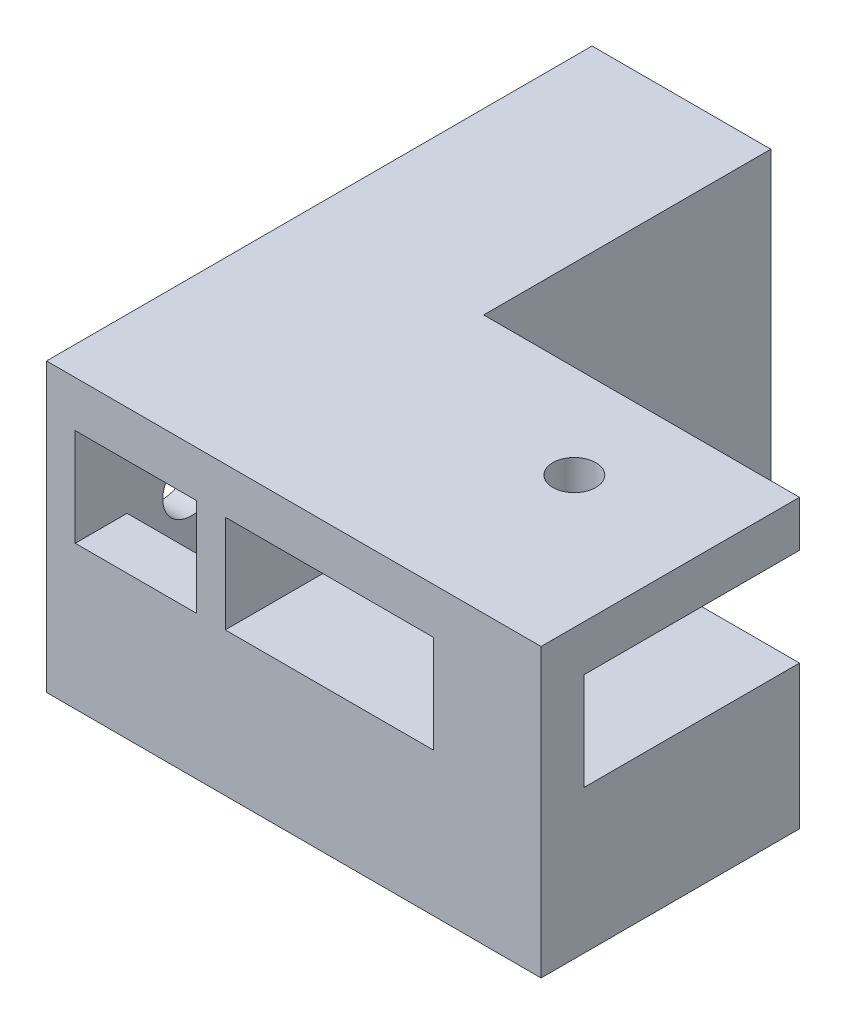
ISO-10303-21;
HEADER;
FILE_DESCRIPTION(('STEP AP214'),'2;1');
FILE_NAME('part.step','',(''),(''),'','','');
FILE_SCHEMA(('AUTOMOTIVE_DESIGN { 1 0 10303 214 1 1 1 1 }'));
ENDSEC;
DATA;
#1=APPLICATION_CONTEXT('core data for automotive mechanical design processes');
#2=APPLICATION_PROTOCOL_DEFINITION('international standard','automotive_design',2000,#1);
#3=PRODUCT_CONTEXT('',#1,'mechanical');
#4=PRODUCT('Part','Part','',(#3));
#5=PRODUCT_RELATED_PRODUCT_CATEGORY('part','',(#4));
#6=PRODUCT_DEFINITION_FORMATION('','',#4);
#7=PRODUCT_DEFINITION_CONTEXT('part definition',#1,'design');
#8=PRODUCT_DEFINITION('design','',#6,#7);
#9=PRODUCT_DEFINITION_SHAPE('','',#8);
#10=(LENGTH_UNIT() NAMED_UNIT(*) SI_UNIT(.MILLI.,.METRE.));
#11=(NAMED_UNIT(*) PLANE_ANGLE_UNIT() SI_UNIT($,.RADIAN.));
#12=(NAMED_UNIT(*) SI_UNIT($,.STERADIAN.) SOLID_ANGLE_UNIT());
#13=UNCERTAINTY_MEASURE_WITH_UNIT(LENGTH_MEASURE(1.E-05),#10,'distance_accuracy_value','');
#14=(GEOMETRIC_REPRESENTATION_CONTEXT(3) GLOBAL_UNCERTAINTY_ASSIGNED_CONTEXT((#13)) GLOBAL_UNIT_ASSIGNED_CONTEXT((#10,
#11,#12)) REPRESENTATION_CONTEXT('',''));
#15=CARTESIAN_POINT('',(0.,0.,0.));
#16=DIRECTION('',(0.,0.,1.));
#17=DIRECTION('',(1.,0.,0.));
#18=AXIS2_PLACEMENT_3D('',#15,#16,#17);
#19=CARTESIAN_POINT('',(0.,5.,-18.));
#20=DIRECTION('',(0.,1.,0.));
#21=DIRECTION('',(0.,0.,1.));
#22=AXIS2_PLACEMENT_3D('',#19,#20,#21);
#23=PLANE('',#22);
#24=DIRECTION('',(-1.,0.,0.));
#25=VECTOR('',#24,1.);
#26=CARTESIAN_POINT('',(0.,5.,-15.9436413169626));
#27=LINE('',#26,#25);
#28=CARTESIAN_POINT('',(-4.375,4.99999999986514,-15.9436413171899));
#29=VERTEX_POINT('',#28);
#30=CARTESIAN_POINT('',(-12.825,4.99999999995493,-15.9436413170386));
#31=VERTEX_POINT('',#30);
#32=EDGE_CURVE('E277',#29,#31,#27,.T.);
#33=ORIENTED_EDGE('',*,*,#32,.F.);
#34=DIRECTION('',(0.,0.,1.));
#35=VECTOR('',#34,1.);
#36=CARTESIAN_POINT('',(-4.37500000000001,5.,-38.));
#37=LINE('',#36,#35);
#38=CARTESIAN_POINT('',(-4.375,5.,-38.));
#39=VERTEX_POINT('',#38);
#40=EDGE_CURVE('E248',#39,#29,#37,.T.);
#41=ORIENTED_EDGE('',*,*,#40,.F.);
#42=DIRECTION('',(-1.,0.,0.));
#43=VECTOR('',#42,1.);
#44=CARTESIAN_POINT('',(0.,5.,-38.));
#45=LINE('',#44,#43);
#46=CARTESIAN_POINT('',(-12.825,5.,-38.));
#47=VERTEX_POINT('',#46);
#48=EDGE_CURVE('E449',#39,#47,#45,.T.);
#49=ORIENTED_EDGE('',*,*,#48,.T.);
#50=DIRECTION('',(0.,0.,-1.));
#51=VECTOR('',#50,1.);
#52=CARTESIAN_POINT('',(-12.825,5.,-38.));
#53=LINE('',#52,#51);
#54=EDGE_CURVE('E310',#31,#47,#53,.T.);
#55=ORIENTED_EDGE('',*,*,#54,.F.);
#56=EDGE_LOOP('',(#33,#41,#49,#55));
#57=FACE_BOUND('',#56,.T.);
#58=ADVANCED_FACE('F40',(#57),#23,.T.);
#59=CARTESIAN_POINT('',(10.44201924,5.,-11.5));
#60=DIRECTION('',(0.,1.,0.));
#61=DIRECTION('',(0.,0.,1.));
#62=AXIS2_PLACEMENT_3D('',#59,#60,#61);
#63=CIRCLE('',#62,1.5);
#64=CARTESIAN_POINT('',(10.44201924,5.,-10.));
#65=VERTEX_POINT('',#64);
#66=EDGE_CURVE('E397',#65,#65,#63,.F.);
#67=ORIENTED_EDGE('',*,*,#66,.T.);
#68=EDGE_LOOP('',(#67));
#69=FACE_BOUND('',#68,.T.);
#70=DIRECTION('',(0.,0.,1.));
#71=VECTOR('',#70,1.);
#72=CARTESIAN_POINT('',(12.125,4.99999999999545,0.));
#73=LINE('',#72,#71);
#74=CARTESIAN_POINT('',(12.125,4.99999999999545,-3.));
#75=VERTEX_POINT('',#74);
#76=CARTESIAN_POINT('',(12.125,4.99999999999545,0.));
#77=VERTEX_POINT('',#76);
#78=EDGE_CURVE('E307',#75,#77,#73,.T.);
#79=ORIENTED_EDGE('',*,*,#78,.F.);
#80=DIRECTION('',(-1.,0.,0.));
#81=VECTOR('',#80,1.);
#82=CARTESIAN_POINT('',(19.625,4.99999999999545,-3.));
#83=LINE('',#82,#81);
#84=CARTESIAN_POINT('',(19.625,4.99999999999545,-3.));
#85=VERTEX_POINT('',#84);
#86=EDGE_CURVE('E304',#85,#75,#83,.T.);
#87=ORIENTED_EDGE('',*,*,#86,.F.);
#88=DIRECTION('',(0.,0.,1.));
#89=VECTOR('',#88,1.);
#90=CARTESIAN_POINT('',(19.625,5.,0.));
#91=LINE('',#90,#89);
#92=CARTESIAN_POINT('',(19.625,5.,-18.));
#93=VERTEX_POINT('',#92);
#94=EDGE_CURVE('E413',#93,#85,#91,.T.);
#95=ORIENTED_EDGE('',*,*,#94,.F.);
#96=DIRECTION('',(-1.,0.,0.));
#97=VECTOR('',#96,1.);
#98=CARTESIAN_POINT('',(0.,5.,-18.));
#99=LINE('',#98,#97);
#100=CARTESIAN_POINT('',(-2.375,5.,-18.));
#101=VERTEX_POINT('',#100);
#102=EDGE_CURVE('E645',#93,#101,#99,.T.);
#103=ORIENTED_EDGE('',*,*,#102,.T.);
#104=DIRECTION('',(0.,0.,-1.));
#105=VECTOR('',#104,1.);
#106=CARTESIAN_POINT('',(-2.37500000000001,5.,-38.));
#107=LINE('',#106,#105);
#108=CARTESIAN_POINT('',(-2.375,5.,0.));
#109=VERTEX_POINT('',#108);
#110=EDGE_CURVE('E388',#109,#101,#107,.T.);
#111=ORIENTED_EDGE('',*,*,#110,.F.);
#112=DIRECTION('',(-1.,0.,0.));
#113=VECTOR('',#112,1.);
#114=CARTESIAN_POINT('',(0.,5.,0.));
#115=LINE('',#114,#113);
#116=EDGE_CURVE('E632',#77,#109,#115,.T.);
#117=ORIENTED_EDGE('',*,*,#116,.F.);
#118=EDGE_LOOP('',(#79,#87,#95,#103,#111,#117));
#119=FACE_BOUND('',#118,.T.);
#120=ADVANCED_FACE('F509',(#69,#119),#23,.T.);
#121=CARTESIAN_POINT('',(0.,11.8,-18.));
#122=DIRECTION('',(0.,1.,0.));
#123=DIRECTION('',(0.,0.,1.));
#124=AXIS2_PLACEMENT_3D('',#121,#122,#123);
#125=PLANE('',#124);
#126=CARTESIAN_POINT('',(10.44201924,11.8,-11.5));
#127=DIRECTION('',(0.,1.,0.));
#128=DIRECTION('',(0.,0.,1.));
#129=AXIS2_PLACEMENT_3D('',#126,#127,#128);
#130=CIRCLE('',#129,1.5);
#131=CARTESIAN_POINT('',(10.44201924,11.8,-10.));
#132=VERTEX_POINT('',#131);
#133=EDGE_CURVE('E329',#132,#132,#130,.F.);
#134=ORIENTED_EDGE('',*,*,#133,.F.);
#135=EDGE_LOOP('',(#134));
#136=FACE_BOUND('',#135,.T.);
#137=DIRECTION('',(1.,0.,0.));
#138=VECTOR('',#137,1.);
#139=CARTESIAN_POINT('',(19.625,11.8,-3.));
#140=LINE('',#139,#138);
#141=CARTESIAN_POINT('',(12.125,11.8,-3.));
#142=VERTEX_POINT('',#141);
#143=CARTESIAN_POINT('',(19.625,11.8,-3.));
#144=VERTEX_POINT('',#143);
#145=EDGE_CURVE('E62',#142,#144,#140,.T.);
#146=ORIENTED_EDGE('',*,*,#145,.F.);
#147=DIRECTION('',(0.,0.,-1.));
#148=VECTOR('',#147,1.);
#149=CARTESIAN_POINT('',(12.125,11.8,0.));
#150=LINE('',#149,#148);
#151=CARTESIAN_POINT('',(12.125,11.8,0.));
#152=VERTEX_POINT('',#151);
#153=EDGE_CURVE('E289',#152,#142,#150,.T.);
#154=ORIENTED_EDGE('',*,*,#153,.F.);
#155=DIRECTION('',(-1.,0.,0.));
#156=VECTOR('',#155,1.);
#157=CARTESIAN_POINT('',(0.,11.8,0.));
#158=LINE('',#157,#156);
#159=CARTESIAN_POINT('',(-2.375,11.7999999999938,0.));
#160=VERTEX_POINT('',#159);
#161=EDGE_CURVE('E596',#152,#160,#158,.T.);
#162=ORIENTED_EDGE('',*,*,#161,.T.);
#163=DIRECTION('',(0.,0.,-1.));
#164=VECTOR('',#163,1.);
#165=CARTESIAN_POINT('',(-2.37500000000001,11.7999999999938,-38.));
#166=LINE('',#165,#164);
#167=CARTESIAN_POINT('',(-2.375,11.7999999999938,-18.));
#168=VERTEX_POINT('',#167);
#169=EDGE_CURVE('E371',#160,#168,#166,.T.);
#170=ORIENTED_EDGE('',*,*,#169,.T.);
#171=DIRECTION('',(-1.,0.,0.));
#172=VECTOR('',#171,1.);
#173=CARTESIAN_POINT('',(0.,11.8,-18.));
#174=LINE('',#173,#172);
#175=CARTESIAN_POINT('',(19.625,11.8,-18.));
#176=VERTEX_POINT('',#175);
#177=EDGE_CURVE('E595',#176,#168,#174,.T.);
#178=ORIENTED_EDGE('',*,*,#177,.F.);
#179=DIRECTION('',(0.,0.,-1.));
#180=VECTOR('',#179,1.);
#181=CARTESIAN_POINT('',(19.625,11.8,0.));
#182=LINE('',#181,#180);
#183=EDGE_CURVE('E333',#144,#176,#182,.T.);
#184=ORIENTED_EDGE('',*,*,#183,.F.);
#185=EDGE_LOOP('',(#146,#154,#162,#170,#178,#184));
#186=FACE_BOUND('',#185,.T.);
#187=ADVANCED_FACE('F513',(#136,#186),#125,.F.);
#188=DIRECTION('',(-1.,0.,0.));
#189=VECTOR('',#188,1.);
#190=CARTESIAN_POINT('',(11.4417453763892,5.,-3.61207246935829));
#191=LINE('',#190,#189);
#192=CARTESIAN_POINT('',(-12.825,5.,-3.61207246935829));
#193=VERTEX_POINT('',#192);
#194=CARTESIAN_POINT('',(-4.375,5.,-3.61207246935829));
#195=VERTEX_POINT('',#194);
#196=EDGE_CURVE('E274',#193,#195,#191,.F.);
#197=ORIENTED_EDGE('',*,*,#196,.F.);
#198=CARTESIAN_POINT('',(-12.825,5.,0.));
#199=VERTEX_POINT('',#198);
#200=EDGE_CURVE('E73',#199,#193,#53,.T.);
#201=ORIENTED_EDGE('',*,*,#200,.F.);
#202=CARTESIAN_POINT('',(-4.375,5.,0.));
#203=VERTEX_POINT('',#202);
#204=EDGE_CURVE('E458',#203,#199,#115,.T.);
#205=ORIENTED_EDGE('',*,*,#204,.F.);
#206=EDGE_CURVE('E44',#195,#203,#37,.T.);
#207=ORIENTED_EDGE('',*,*,#206,.F.);
#208=EDGE_LOOP('',(#197,#201,#205,#207));
#209=FACE_BOUND('',#208,.T.);
#210=ADVANCED_FACE('F42',(#209),#23,.T.);
#211=DIRECTION('',(0.,0.,-1.));
#212=VECTOR('',#211,1.);
#213=CARTESIAN_POINT('',(-12.825,11.7999999999938,-38.));
#214=LINE('',#213,#212);
#215=CARTESIAN_POINT('',(-12.825,11.7999999999938,0.));
#216=VERTEX_POINT('',#215);
#217=CARTESIAN_POINT('',(-12.825,11.7999999999938,-38.));
#218=VERTEX_POINT('',#217);
#219=EDGE_CURVE('E318',#216,#218,#214,.T.);
#220=ORIENTED_EDGE('',*,*,#219,.T.);
#221=DIRECTION('',(-1.,0.,0.));
#222=VECTOR('',#221,1.);
#223=CARTESIAN_POINT('',(0.,11.8,-38.));
#224=LINE('',#223,#222);
#225=CARTESIAN_POINT('',(-4.37500000000001,11.7999999999938,-38.));
#226=VERTEX_POINT('',#225);
#227=EDGE_CURVE('E344',#226,#218,#224,.T.);
#228=ORIENTED_EDGE('',*,*,#227,.F.);
#229=DIRECTION('',(0.,0.,1.));
#230=VECTOR('',#229,1.);
#231=CARTESIAN_POINT('',(-4.37500000000001,11.7999999999938,-38.));
#232=LINE('',#231,#230);
#233=CARTESIAN_POINT('',(-4.375,11.8,0.));
#234=VERTEX_POINT('',#233);
#235=EDGE_CURVE('E383',#226,#234,#232,.T.);
#236=ORIENTED_EDGE('',*,*,#235,.T.);
#237=EDGE_CURVE('E353',#234,#216,#158,.T.);
#238=ORIENTED_EDGE('',*,*,#237,.T.);
#239=EDGE_LOOP('',(#220,#228,#236,#238));
#240=FACE_BOUND('',#239,.T.);
#241=ADVANCED_FACE('F476',(#240),#125,.F.);
#242=CARTESIAN_POINT('',(0.,-2.,-38.));
#243=DIRECTION('',(0.,-1.,0.));
#244=DIRECTION('',(0.,0.,-1.));
#245=AXIS2_PLACEMENT_3D('',#242,#243,#244);
#246=PLANE('',#245);
#247=DIRECTION('',(0.,0.,1.));
#248=VECTOR('',#247,1.);
#249=CARTESIAN_POINT('',(-9.825,-2.,-38.));
#250=LINE('',#249,#248);
#251=CARTESIAN_POINT('',(-9.825,-2.,-38.));
#252=VERTEX_POINT('',#251);
#253=CARTESIAN_POINT('',(-9.825,-2.,-10.));
#254=VERTEX_POINT('',#253);
#255=EDGE_CURVE('E481',#252,#254,#250,.T.);
#256=ORIENTED_EDGE('',*,*,#255,.T.);
#257=DIRECTION('',(1.,0.,0.));
#258=VECTOR('',#257,1.);
#259=CARTESIAN_POINT('',(0.,-2.,-10.));
#260=LINE('',#259,#258);
#261=CARTESIAN_POINT('',(-14.825,-2.,-10.));
#262=VERTEX_POINT('',#261);
#263=EDGE_CURVE('E421',#262,#254,#260,.T.);
#264=ORIENTED_EDGE('',*,*,#263,.F.);
#265=DIRECTION('',(0.,0.,1.));
#266=VECTOR('',#265,1.);
#267=CARTESIAN_POINT('',(-14.825,-2.,-38.));
#268=LINE('',#267,#266);
#269=CARTESIAN_POINT('',(-14.825,-2.,-38.));
#270=VERTEX_POINT('',#269);
#271=EDGE_CURVE('E629',#270,#262,#268,.T.);
#272=ORIENTED_EDGE('',*,*,#271,.F.);
#273=DIRECTION('',(1.,0.,0.));
#274=VECTOR('',#273,1.);
#275=CARTESIAN_POINT('',(0.,-2.,-38.));
#276=LINE('',#275,#274);
#277=EDGE_CURVE('E435',#270,#252,#276,.T.);
#278=ORIENTED_EDGE('',*,*,#277,.T.);
#279=EDGE_LOOP('',(#256,#264,#272,#278));
#280=FACE_BOUND('',#279,.T.);
#281=ADVANCED_FACE('F520',(#280),#246,.T.);
#282=CARTESIAN_POINT('',(-9.825,0.,-38.));
#283=DIRECTION('',(-1.,0.,0.));
#284=DIRECTION('',(0.,0.,1.));
#285=AXIS2_PLACEMENT_3D('',#282,#283,#284);
#286=PLANE('',#285);
#287=DIRECTION('',(0.,0.,1.));
#288=VECTOR('',#287,1.);
#289=CARTESIAN_POINT('',(-9.825,-5.,-38.));
#290=LINE('',#289,#288);
#291=CARTESIAN_POINT('',(-9.825,-5.,-38.));
#292=VERTEX_POINT('',#291);
#293=CARTESIAN_POINT('',(-9.825,-5.,-10.));
#294=VERTEX_POINT('',#293);
#295=EDGE_CURVE('E483',#292,#294,#290,.T.);
#296=ORIENTED_EDGE('',*,*,#295,.T.);
#297=DIRECTION('',(0.,-1.,0.));
#298=VECTOR('',#297,1.);
#299=CARTESIAN_POINT('',(-9.825,0.,-10.));
#300=LINE('',#299,#298);
#301=EDGE_CURVE('E417',#254,#294,#300,.T.);
#302=ORIENTED_EDGE('',*,*,#301,.F.);
#303=ORIENTED_EDGE('',*,*,#255,.F.);
#304=DIRECTION('',(0.,-1.,0.));
#305=VECTOR('',#304,1.);
#306=CARTESIAN_POINT('',(-9.825,0.,-38.));
#307=LINE('',#306,#305);
#308=EDGE_CURVE('E439',#252,#292,#307,.T.);
#309=ORIENTED_EDGE('',*,*,#308,.T.);
#310=EDGE_LOOP('',(#296,#302,#303,#309));
#311=FACE_BOUND('',#310,.T.);
#312=ADVANCED_FACE('F685',(#311),#286,.T.);
#313=CARTESIAN_POINT('',(0.,-5.,-18.));
#314=DIRECTION('',(0.,1.,0.));
#315=DIRECTION('',(-1.,0.,0.));
#316=AXIS2_PLACEMENT_3D('',#313,#314,#315);
#317=PLANE('',#316);
#318=CARTESIAN_POINT('',(10.44201924,-5.,-11.5));
#319=DIRECTION('',(0.,1.,0.));
#320=DIRECTION('',(-1.,0.,0.));
#321=AXIS2_PLACEMENT_3D('',#318,#319,#320);
#322=CIRCLE('',#321,1.5);
#323=CARTESIAN_POINT('',(8.94201924000001,-5.,-11.5));
#324=VERTEX_POINT('',#323);
#325=EDGE_CURVE('E393',#324,#324,#322,.F.);
#326=ORIENTED_EDGE('',*,*,#325,.F.);
#327=EDGE_LOOP('',(#326));
#328=FACE_BOUND('',#327,.T.);
#329=DIRECTION('',(-1.,0.,0.));
#330=VECTOR('',#329,1.);
#331=CARTESIAN_POINT('',(0.,-5.,0.));
#332=LINE('',#331,#330);
#333=CARTESIAN_POINT('',(19.625,-5.,0.));
#334=VERTEX_POINT('',#333);
#335=CARTESIAN_POINT('',(-14.825,-5.,0.));
#336=VERTEX_POINT('',#335);
#337=EDGE_CURVE('E588',#334,#336,#332,.T.);
#338=ORIENTED_EDGE('',*,*,#337,.T.);
#339=DIRECTION('',(0.,0.,1.));
#340=VECTOR('',#339,1.);
#341=CARTESIAN_POINT('',(-14.825,-5.,-10.));
#342=LINE('',#341,#340);
#343=CARTESIAN_POINT('',(-14.825,-5.,-10.));
#344=VERTEX_POINT('',#343);
#345=EDGE_CURVE('E430',#344,#336,#342,.T.);
#346=ORIENTED_EDGE('',*,*,#345,.F.);
#347=DIRECTION('',(-1.,0.,0.));
#348=VECTOR('',#347,1.);
#349=CARTESIAN_POINT('',(0.,-5.,-10.));
#350=LINE('',#349,#348);
#351=EDGE_CURVE('E427',#294,#344,#350,.T.);
#352=ORIENTED_EDGE('',*,*,#351,.F.);
#353=ORIENTED_EDGE('',*,*,#295,.F.);
#354=DIRECTION('',(-1.,0.,0.));
#355=VECTOR('',#354,1.);
#356=CARTESIAN_POINT('',(0.,-5.,-38.));
#357=LINE('',#356,#355);
#358=CARTESIAN_POINT('',(-2.375,-5.,-38.));
#359=VERTEX_POINT('',#358);
#360=EDGE_CURVE('E443',#359,#292,#357,.T.);
#361=ORIENTED_EDGE('',*,*,#360,.F.);
#362=DIRECTION('',(0.,0.,1.));
#363=VECTOR('',#362,1.);
#364=CARTESIAN_POINT('',(-2.375,-5.,-38.));
#365=LINE('',#364,#363);
#366=CARTESIAN_POINT('',(-2.375,-5.,-18.));
#367=VERTEX_POINT('',#366);
#368=EDGE_CURVE('E617',#359,#367,#365,.T.);
#369=ORIENTED_EDGE('',*,*,#368,.T.);
#370=DIRECTION('',(-1.,0.,0.));
#371=VECTOR('',#370,1.);
#372=CARTESIAN_POINT('',(0.,-5.,-18.));
#373=LINE('',#372,#371);
#374=CARTESIAN_POINT('',(19.625,-5.,-18.));
#375=VERTEX_POINT('',#374);
#376=EDGE_CURVE('E11',#375,#367,#373,.T.);
#377=ORIENTED_EDGE('',*,*,#376,.F.);
#378=DIRECTION('',(0.,0.,-1.));
#379=VECTOR('',#378,1.);
#380=CARTESIAN_POINT('',(19.625,-5.,0.));
#381=LINE('',#380,#379);
#382=EDGE_CURVE('E405',#334,#375,#381,.T.);
#383=ORIENTED_EDGE('',*,*,#382,.F.);
#384=EDGE_LOOP('',(#338,#346,#352,#353,#361,#369,#377,#383));
#385=FACE_BOUND('',#384,.T.);
#386=ADVANCED_FACE('F678',(#328,#385),#317,.F.);
#387=CARTESIAN_POINT('',(0.,0.,-18.));
#388=DIRECTION('',(0.,0.,1.));
#389=DIRECTION('',(1.,0.,0.));
#390=AXIS2_PLACEMENT_3D('',#387,#388,#389);
#391=PLANE('',#390);
#392=ORIENTED_EDGE('',*,*,#102,.F.);
#393=DIRECTION('',(0.,1.,0.));
#394=VECTOR('',#393,1.);
#395=CARTESIAN_POINT('',(19.625,5.,-18.));
#396=LINE('',#395,#394);
#397=EDGE_CURVE('E409',#375,#93,#396,.T.);
#398=ORIENTED_EDGE('',*,*,#397,.F.);
#399=ORIENTED_EDGE('',*,*,#376,.T.);
#400=DIRECTION('',(0.,-1.,0.));
#401=VECTOR('',#400,1.);
#402=CARTESIAN_POINT('',(-2.375,0.,-18.));
#403=LINE('',#402,#401);
#404=EDGE_CURVE('E51',#101,#367,#403,.T.);
#405=ORIENTED_EDGE('',*,*,#404,.F.);
#406=EDGE_LOOP('',(#392,#398,#399,#405));
#407=FACE_BOUND('',#406,.T.);
#408=ADVANCED_FACE('F675',(#407),#391,.F.);
#409=CARTESIAN_POINT('',(0.,0.,0.));
#410=DIRECTION('',(0.,0.,1.));
#411=DIRECTION('',(1.,0.,0.));
#412=AXIS2_PLACEMENT_3D('',#409,#410,#411);
#413=PLANE('',#412);
#414=DIRECTION('',(0.,1.,0.));
#415=VECTOR('',#414,1.);
#416=CARTESIAN_POINT('',(12.125,-500000.,0.));
#417=LINE('',#416,#415);
#418=EDGE_CURVE('E301',#77,#152,#417,.T.);
#419=ORIENTED_EDGE('',*,*,#418,.F.);
#420=ORIENTED_EDGE('',*,*,#116,.T.);
#421=DIRECTION('',(0.,-1.,0.));
#422=VECTOR('',#421,1.);
#423=CARTESIAN_POINT('',(-2.37500000005515,500000.,0.));
#424=LINE('',#423,#422);
#425=EDGE_CURVE('E365',#160,#109,#424,.T.);
#426=ORIENTED_EDGE('',*,*,#425,.F.);
#427=ORIENTED_EDGE('',*,*,#161,.F.);
#428=EDGE_LOOP('',(#419,#420,#426,#427));
#429=FACE_BOUND('',#428,.T.);
#430=ORIENTED_EDGE('',*,*,#204,.T.);
#431=DIRECTION('',(0.,-1.,0.));
#432=VECTOR('',#431,1.);
#433=CARTESIAN_POINT('',(-12.8250000000552,500000.,0.));
#434=LINE('',#433,#432);
#435=EDGE_CURVE('E314',#216,#199,#434,.T.);
#436=ORIENTED_EDGE('',*,*,#435,.F.);
#437=ORIENTED_EDGE('',*,*,#237,.F.);
#438=DIRECTION('',(0.,-1.,0.));
#439=VECTOR('',#438,1.);
#440=CARTESIAN_POINT('',(-4.37500000005515,500000.,0.));
#441=LINE('',#440,#439);
#442=EDGE_CURVE('E372',#234,#203,#441,.T.);
#443=ORIENTED_EDGE('',*,*,#442,.T.);
#444=EDGE_LOOP('',(#430,#436,#437,#443));
#445=FACE_BOUND('',#444,.T.);
#446=DIRECTION('',(0.,-1.,0.));
#447=VECTOR('',#446,1.);
#448=CARTESIAN_POINT('',(19.625,5.,0.));
#449=LINE('',#448,#447);
#450=CARTESIAN_POINT('',(19.625,15.,0.));
#451=VERTEX_POINT('',#450);
#452=EDGE_CURVE('E401',#451,#334,#449,.T.);
#453=ORIENTED_EDGE('',*,*,#452,.F.);
#454=DIRECTION('',(-1.,0.,0.));
#455=VECTOR('',#454,1.);
#456=CARTESIAN_POINT('',(0.,15.,0.));
#457=LINE('',#456,#455);
#458=CARTESIAN_POINT('',(-14.825,15.,0.));
#459=VERTEX_POINT('',#458);
#460=EDGE_CURVE('E585',#451,#459,#457,.T.);
#461=ORIENTED_EDGE('',*,*,#460,.T.);
#462=DIRECTION('',(0.,1.,0.));
#463=VECTOR('',#462,1.);
#464=CARTESIAN_POINT('',(-14.825,0.,0.));
#465=LINE('',#464,#463);
#466=EDGE_CURVE('E434',#336,#459,#465,.T.);
#467=ORIENTED_EDGE('',*,*,#466,.F.);
#468=ORIENTED_EDGE('',*,*,#337,.F.);
#469=EDGE_LOOP('',(#453,#461,#467,#468));
#470=FACE_BOUND('',#469,.T.);
#471=ADVANCED_FACE('F467',(#429,#445,#470),#413,.T.);
#472=CARTESIAN_POINT('',(-2.375,0.,-38.));
#473=DIRECTION('',(-1.,0.,0.));
#474=DIRECTION('',(0.,-1.,0.));
#475=AXIS2_PLACEMENT_3D('',#472,#473,#474);
#476=PLANE('',#475);
#477=DIRECTION('',(0.,-1.,0.));
#478=VECTOR('',#477,1.);
#479=CARTESIAN_POINT('',(-2.375,0.,-38.));
#480=LINE('',#479,#478);
#481=CARTESIAN_POINT('',(-2.375,15.,-38.));
#482=VERTEX_POINT('',#481);
#483=EDGE_CURVE('E446',#482,#359,#480,.T.);
#484=ORIENTED_EDGE('',*,*,#483,.F.);
#485=DIRECTION('',(0.,0.,1.));
#486=VECTOR('',#485,1.);
#487=CARTESIAN_POINT('',(-2.375,15.,-38.));
#488=LINE('',#487,#486);
#489=CARTESIAN_POINT('',(-2.375,15.,-18.));
#490=VERTEX_POINT('',#489);
#491=EDGE_CURVE('E479',#482,#490,#488,.T.);
#492=ORIENTED_EDGE('',*,*,#491,.T.);
#493=DIRECTION('',(0.,1.,0.));
#494=VECTOR('',#493,1.);
#495=CARTESIAN_POINT('',(-2.375,0.,-18.));
#496=LINE('',#495,#494);
#497=EDGE_CURVE('E392',#168,#490,#496,.T.);
#498=ORIENTED_EDGE('',*,*,#497,.F.);
#499=ORIENTED_EDGE('',*,*,#169,.F.);
#500=ORIENTED_EDGE('',*,*,#425,.T.);
#501=ORIENTED_EDGE('',*,*,#110,.T.);
#502=ORIENTED_EDGE('',*,*,#404,.T.);
#503=ORIENTED_EDGE('',*,*,#368,.F.);
#504=EDGE_LOOP('',(#484,#492,#498,#499,#500,#501,#502,#503));
#505=FACE_BOUND('',#504,.T.);
#506=ADVANCED_FACE('F505',(#505),#476,.F.);
#507=CARTESIAN_POINT('',(-14.825,0.,-38.));
#508=DIRECTION('',(1.,0.,0.));
#509=DIRECTION('',(0.,0.,-1.));
#510=AXIS2_PLACEMENT_3D('',#507,#508,#509);
#511=PLANE('',#510);
#512=CARTESIAN_POINT('',(-14.825,4.60953503060943,-8.09510014133165));
#513=DIRECTION('',(-1.,0.,0.));
#514=DIRECTION('',(0.,-1.,0.));
#515=AXIS2_PLACEMENT_3D('',#512,#513,#514);
#516=CIRCLE('',#515,2.);
#517=CARTESIAN_POINT('',(-14.825,2.60953503060943,-8.09510014133165));
#518=VERTEX_POINT('',#517);
#519=EDGE_CURVE('E281',#518,#518,#516,.T.);
#520=ORIENTED_EDGE('',*,*,#519,.F.);
#521=EDGE_LOOP('',(#520));
#522=FACE_BOUND('',#521,.T.);
#523=ORIENTED_EDGE('',*,*,#466,.T.);
#524=DIRECTION('',(0.,0.,1.));
#525=VECTOR('',#524,1.);
#526=CARTESIAN_POINT('',(-14.825,15.,-38.));
#527=LINE('',#526,#525);
#528=CARTESIAN_POINT('',(-14.825,15.,-38.));
#529=VERTEX_POINT('',#528);
#530=EDGE_CURVE('E593',#529,#459,#527,.T.);
#531=ORIENTED_EDGE('',*,*,#530,.F.);
#532=DIRECTION('',(0.,1.,0.));
#533=VECTOR('',#532,1.);
#534=CARTESIAN_POINT('',(-14.825,0.,-38.));
#535=LINE('',#534,#533);
#536=EDGE_CURVE('E452',#270,#529,#535,.T.);
#537=ORIENTED_EDGE('',*,*,#536,.F.);
#538=ORIENTED_EDGE('',*,*,#271,.T.);
#539=DIRECTION('',(0.,1.,0.));
#540=VECTOR('',#539,1.);
#541=CARTESIAN_POINT('',(-14.825,0.,-10.));
#542=LINE('',#541,#540);
#543=EDGE_CURVE('E424',#344,#262,#542,.T.);
#544=ORIENTED_EDGE('',*,*,#543,.F.);
#545=ORIENTED_EDGE('',*,*,#345,.T.);
#546=EDGE_LOOP('',(#523,#531,#537,#538,#544,#545));
#547=FACE_BOUND('',#546,.T.);
#548=ADVANCED_FACE('F495',(#522,#547),#511,.F.);
#549=CARTESIAN_POINT('',(0.,0.,-38.));
#550=DIRECTION('',(0.,0.,1.));
#551=DIRECTION('',(1.,0.,0.));
#552=AXIS2_PLACEMENT_3D('',#549,#550,#551);
#553=PLANE('',#552);
#554=ORIENTED_EDGE('',*,*,#536,.T.);
#555=DIRECTION('',(-1.,0.,0.));
#556=VECTOR('',#555,1.);
#557=CARTESIAN_POINT('',(0.,15.,-38.));
#558=LINE('',#557,#556);
#559=EDGE_CURVE('E347',#482,#529,#558,.T.);
#560=ORIENTED_EDGE('',*,*,#559,.F.);
#561=ORIENTED_EDGE('',*,*,#483,.T.);
#562=ORIENTED_EDGE('',*,*,#360,.T.);
#563=ORIENTED_EDGE('',*,*,#308,.F.);
#564=ORIENTED_EDGE('',*,*,#277,.F.);
#565=EDGE_LOOP('',(#554,#560,#561,#562,#563,#564));
#566=FACE_BOUND('',#565,.T.);
#567=DIRECTION('',(0.,-1.,0.));
#568=VECTOR('',#567,1.);
#569=CARTESIAN_POINT('',(-12.8250000000552,500000.,-38.));
#570=LINE('',#569,#568);
#571=EDGE_CURVE('E313',#218,#47,#570,.T.);
#572=ORIENTED_EDGE('',*,*,#571,.T.);
#573=ORIENTED_EDGE('',*,*,#48,.F.);
#574=DIRECTION('',(0.,-1.,0.));
#575=VECTOR('',#574,1.);
#576=CARTESIAN_POINT('',(-4.37500000005517,500000.,-38.));
#577=LINE('',#576,#575);
#578=EDGE_CURVE('E368',#226,#39,#577,.T.);
#579=ORIENTED_EDGE('',*,*,#578,.F.);
#580=ORIENTED_EDGE('',*,*,#227,.T.);
#581=EDGE_LOOP('',(#572,#573,#579,#580));
#582=FACE_BOUND('',#581,.T.);
#583=ADVANCED_FACE('F492',(#566,#582),#553,.F.);
#584=CARTESIAN_POINT('',(0.,0.,-10.));
#585=DIRECTION('',(0.,0.,1.));
#586=DIRECTION('',(1.,0.,0.));
#587=AXIS2_PLACEMENT_3D('',#584,#585,#586);
#588=PLANE('',#587);
#589=ORIENTED_EDGE('',*,*,#301,.T.);
#590=ORIENTED_EDGE('',*,*,#351,.T.);
#591=ORIENTED_EDGE('',*,*,#543,.T.);
#592=ORIENTED_EDGE('',*,*,#263,.T.);
#593=EDGE_LOOP('',(#589,#590,#591,#592));
#594=FACE_BOUND('',#593,.T.);
#595=ADVANCED_FACE('F494',(#594),#588,.F.);
#596=CARTESIAN_POINT('',(19.625,0.,0.));
#597=DIRECTION('',(1.,0.,0.));
#598=DIRECTION('',(0.,0.,-1.));
#599=AXIS2_PLACEMENT_3D('',#596,#597,#598);
#600=PLANE('',#599);
#601=ORIENTED_EDGE('',*,*,#452,.T.);
#602=ORIENTED_EDGE('',*,*,#382,.T.);
#603=ORIENTED_EDGE('',*,*,#397,.T.);
#604=ORIENTED_EDGE('',*,*,#94,.T.);
#605=DIRECTION('',(0.,1.,0.));
#606=VECTOR('',#605,1.);
#607=CARTESIAN_POINT('',(19.625,-500000.,-3.));
#608=LINE('',#607,#606);
#609=EDGE_CURVE('E293',#85,#144,#608,.T.);
#610=ORIENTED_EDGE('',*,*,#609,.T.);
#611=ORIENTED_EDGE('',*,*,#183,.T.);
#612=DIRECTION('',(0.,1.,0.));
#613=VECTOR('',#612,1.);
#614=CARTESIAN_POINT('',(19.625,15.,-18.));
#615=LINE('',#614,#613);
#616=CARTESIAN_POINT('',(19.625,15.,-18.));
#617=VERTEX_POINT('',#616);
#618=EDGE_CURVE('E336',#176,#617,#615,.T.);
#619=ORIENTED_EDGE('',*,*,#618,.T.);
#620=DIRECTION('',(0.,0.,1.));
#621=VECTOR('',#620,1.);
#622=CARTESIAN_POINT('',(19.625,15.,0.));
#623=LINE('',#622,#621);
#624=EDGE_CURVE('E340',#617,#451,#623,.T.);
#625=ORIENTED_EDGE('',*,*,#624,.T.);
#626=EDGE_LOOP('',(#601,#602,#603,#604,#610,#611,#619,#625));
#627=FACE_BOUND('',#626,.T.);
#628=ADVANCED_FACE('F502',(#627),#600,.T.);
#629=CARTESIAN_POINT('',(10.44201924,19.2426406871193,-11.5));
#630=DIRECTION('',(0.,-1.,0.));
#631=DIRECTION('',(1.,0.,0.));
#632=AXIS2_PLACEMENT_3D('',#629,#630,#631);
#633=CYLINDRICAL_SURFACE('',#632,1.5);
#634=ORIENTED_EDGE('',*,*,#66,.F.);
#635=EDGE_LOOP('',(#634));
#636=FACE_BOUND('',#635,.T.);
#637=ORIENTED_EDGE('',*,*,#325,.T.);
#638=EDGE_LOOP('',(#637));
#639=FACE_BOUND('',#638,.T.);
#640=ADVANCED_FACE('F572',(#636,#639),#633,.F.);
#641=CARTESIAN_POINT('',(-4.37500000005517,500000.,-38.));
#642=DIRECTION('',(1.,0.,0.));
#643=DIRECTION('',(0.,0.,-1.));
#644=AXIS2_PLACEMENT_3D('',#641,#642,#643);
#645=PLANE('',#644);
#646=ORIENTED_EDGE('',*,*,#40,.T.);
#647=DIRECTION('',(0.,-0.510338679358111,-0.859973506772749));
#648=VECTOR('',#647,1.);
#649=CARTESIAN_POINT('',(-4.375,10.695081489774,-6.34683943183492));
#650=LINE('',#649,#648);
#651=CARTESIAN_POINT('',(-4.37499999999999,4.60953503060943,-16.6016152126922));
#652=VERTEX_POINT('',#651);
#653=EDGE_CURVE('E242',#29,#652,#650,.T.);
#654=ORIENTED_EDGE('',*,*,#653,.T.);
#655=DIRECTION('',(0.,-0.510338679358111,0.859973506772749));
#656=VECTOR('',#655,1.);
#657=CARTESIAN_POINT('',(-4.375,-3.87707736384501,-2.30079476408421));
#658=LINE('',#657,#656);
#659=CARTESIAN_POINT('',(-4.375,0.271522618915901,-9.29161521269217));
#660=VERTEX_POINT('',#659);
#661=EDGE_CURVE('E246',#652,#660,#658,.T.);
#662=ORIENTED_EDGE('',*,*,#661,.T.);
#663=CARTESIAN_POINT('',(-4.375,4.60953503060943,-8.09510014133165));
#664=DIRECTION('',(1.,0.,0.));
#665=DIRECTION('',(0.,0.,-1.));
#666=AXIS2_PLACEMENT_3D('',#663,#664,#665);
#667=CIRCLE('',#666,4.5);
#668=EDGE_CURVE('E278',#660,#195,#667,.F.);
#669=ORIENTED_EDGE('',*,*,#668,.T.);
#670=ORIENTED_EDGE('',*,*,#206,.T.);
#671=ORIENTED_EDGE('',*,*,#442,.F.);
#672=ORIENTED_EDGE('',*,*,#235,.F.);
#673=ORIENTED_EDGE('',*,*,#578,.T.);
#674=EDGE_LOOP('',(#646,#654,#662,#669,#670,#671,#672,#673));
#675=FACE_BOUND('',#674,.T.);
#676=ADVANCED_FACE('F244',(#675),#645,.F.);
#677=CARTESIAN_POINT('',(0.,15.,-18.));
#678=DIRECTION('',(0.,1.,0.));
#679=DIRECTION('',(-1.,0.,0.));
#680=AXIS2_PLACEMENT_3D('',#677,#678,#679);
#681=PLANE('',#680);
#682=CARTESIAN_POINT('',(10.44201924,15.,-11.5));
#683=DIRECTION('',(0.,1.,0.));
#684=DIRECTION('',(-1.,0.,0.));
#685=AXIS2_PLACEMENT_3D('',#682,#683,#684);
#686=CIRCLE('',#685,1.5);
#687=CARTESIAN_POINT('',(8.94201924,15.,-11.5));
#688=VERTEX_POINT('',#687);
#689=EDGE_CURVE('E325',#688,#688,#686,.T.);
#690=ORIENTED_EDGE('',*,*,#689,.F.);
#691=EDGE_LOOP('',(#690));
#692=FACE_BOUND('',#691,.T.);
#693=ORIENTED_EDGE('',*,*,#460,.F.);
#694=ORIENTED_EDGE('',*,*,#624,.F.);
#695=DIRECTION('',(-1.,0.,0.));
#696=VECTOR('',#695,1.);
#697=CARTESIAN_POINT('',(0.,15.,-18.));
#698=LINE('',#697,#696);
#699=EDGE_CURVE('E600',#617,#490,#698,.T.);
#700=ORIENTED_EDGE('',*,*,#699,.T.);
#701=ORIENTED_EDGE('',*,*,#491,.F.);
#702=ORIENTED_EDGE('',*,*,#559,.T.);
#703=ORIENTED_EDGE('',*,*,#530,.T.);
#704=EDGE_LOOP('',(#693,#694,#700,#701,#702,#703));
#705=FACE_BOUND('',#704,.T.);
#706=ADVANCED_FACE('F565',(#692,#705),#681,.T.);
#707=CARTESIAN_POINT('',(0.,0.,-18.));
#708=DIRECTION('',(0.,0.,1.));
#709=DIRECTION('',(1.,0.,0.));
#710=AXIS2_PLACEMENT_3D('',#707,#708,#709);
#711=PLANE('',#710);
#712=ORIENTED_EDGE('',*,*,#177,.T.);
#713=ORIENTED_EDGE('',*,*,#497,.T.);
#714=ORIENTED_EDGE('',*,*,#699,.F.);
#715=ORIENTED_EDGE('',*,*,#618,.F.);
#716=EDGE_LOOP('',(#712,#713,#714,#715));
#717=FACE_BOUND('',#716,.T.);
#718=ADVANCED_FACE('F561',(#717),#711,.F.);
#719=CARTESIAN_POINT('',(10.44201924,19.2426406871193,-11.5));
#720=DIRECTION('',(0.,-1.,0.));
#721=DIRECTION('',(1.,0.,0.));
#722=AXIS2_PLACEMENT_3D('',#719,#720,#721);
#723=CYLINDRICAL_SURFACE('',#722,1.5);
#724=ORIENTED_EDGE('',*,*,#689,.T.);
#725=EDGE_LOOP('',(#724));
#726=FACE_BOUND('',#725,.T.);
#727=ORIENTED_EDGE('',*,*,#133,.T.);
#728=EDGE_LOOP('',(#727));
#729=FACE_BOUND('',#728,.T.);
#730=ADVANCED_FACE('F558',(#726,#729),#723,.F.);
#731=CARTESIAN_POINT('',(-12.8250000000552,500000.,-38.));
#732=DIRECTION('',(-1.,0.,0.));
#733=DIRECTION('',(0.,-1.,0.));
#734=AXIS2_PLACEMENT_3D('',#731,#732,#733);
#735=PLANE('',#734);
#736=DIRECTION('',(0.,-0.510338679358111,-0.859973506772749));
#737=VECTOR('',#736,1.);
#738=CARTESIAN_POINT('',(-12.825,10.695081489774,-6.34683943183492));
#739=LINE('',#738,#737);
#740=CARTESIAN_POINT('',(-12.825,4.60953503060943,-16.6016152126922));
#741=VERTEX_POINT('',#740);
#742=EDGE_CURVE('E267',#31,#741,#739,.T.);
#743=ORIENTED_EDGE('',*,*,#742,.F.);
#744=ORIENTED_EDGE('',*,*,#54,.T.);
#745=ORIENTED_EDGE('',*,*,#571,.F.);
#746=ORIENTED_EDGE('',*,*,#219,.F.);
#747=ORIENTED_EDGE('',*,*,#435,.T.);
#748=ORIENTED_EDGE('',*,*,#200,.T.);
#749=CARTESIAN_POINT('',(-12.825,4.60953503060943,-8.09510014133165));
#750=DIRECTION('',(-1.,0.,0.));
#751=DIRECTION('',(0.,-1.,0.));
#752=AXIS2_PLACEMENT_3D('',#749,#750,#751);
#753=CIRCLE('',#752,4.5);
#754=CARTESIAN_POINT('',(-12.825,0.271522618915901,-9.29161521269217));
#755=VERTEX_POINT('',#754);
#756=EDGE_CURVE('E525',#755,#193,#753,.T.);
#757=ORIENTED_EDGE('',*,*,#756,.F.);
#758=DIRECTION('',(0.,-0.510338679358111,0.859973506772749));
#759=VECTOR('',#758,1.);
#760=CARTESIAN_POINT('',(-12.825,-3.87707736384501,-2.30079476408422));
#761=LINE('',#760,#759);
#762=EDGE_CURVE('E254',#741,#755,#761,.T.);
#763=ORIENTED_EDGE('',*,*,#762,.F.);
#764=EDGE_LOOP('',(#743,#744,#745,#746,#747,#748,#757,#763));
#765=FACE_BOUND('',#764,.T.);
#766=CARTESIAN_POINT('',(-12.825,4.60953503060943,-8.09510014133165));
#767=DIRECTION('',(-1.,0.,0.));
#768=DIRECTION('',(0.,-1.,0.));
#769=AXIS2_PLACEMENT_3D('',#766,#767,#768);
#770=CIRCLE('',#769,2.);
#771=CARTESIAN_POINT('',(-12.825,2.60953503060943,-8.09510014133165));
#772=VERTEX_POINT('',#771);
#773=EDGE_CURVE('E282',#772,#772,#770,.T.);
#774=ORIENTED_EDGE('',*,*,#773,.T.);
#775=EDGE_LOOP('',(#774));
#776=FACE_BOUND('',#775,.T.);
#777=ADVANCED_FACE('F487',(#765,#776),#735,.F.);
#778=CARTESIAN_POINT('',(19.625,-500000.,-3.));
#779=DIRECTION('',(0.,0.,1.));
#780=DIRECTION('',(1.,0.,0.));
#781=AXIS2_PLACEMENT_3D('',#778,#779,#780);
#782=PLANE('',#781);
#783=ORIENTED_EDGE('',*,*,#609,.F.);
#784=ORIENTED_EDGE('',*,*,#86,.T.);
#785=DIRECTION('',(0.,1.,0.));
#786=VECTOR('',#785,1.);
#787=CARTESIAN_POINT('',(12.125,-500000.,-3.));
#788=LINE('',#787,#786);
#789=EDGE_CURVE('E298',#75,#142,#788,.T.);
#790=ORIENTED_EDGE('',*,*,#789,.T.);
#791=ORIENTED_EDGE('',*,*,#145,.T.);
#792=EDGE_LOOP('',(#783,#784,#790,#791));
#793=FACE_BOUND('',#792,.T.);
#794=ADVANCED_FACE('F550',(#793),#782,.F.);
#795=CARTESIAN_POINT('',(12.125,-500000.,0.));
#796=DIRECTION('',(1.,0.,0.));
#797=DIRECTION('',(0.,0.,-1.));
#798=AXIS2_PLACEMENT_3D('',#795,#796,#797);
#799=PLANE('',#798);
#800=ORIENTED_EDGE('',*,*,#789,.F.);
#801=ORIENTED_EDGE('',*,*,#78,.T.);
#802=ORIENTED_EDGE('',*,*,#418,.T.);
#803=ORIENTED_EDGE('',*,*,#153,.T.);
#804=EDGE_LOOP('',(#800,#801,#802,#803));
#805=FACE_BOUND('',#804,.T.);
#806=ADVANCED_FACE('F548',(#805),#799,.F.);
#807=CARTESIAN_POINT('',(-12.825,4.60953503060943,-8.09510014133165));
#808=DIRECTION('',(-1.,0.,0.));
#809=DIRECTION('',(0.,-1.,0.));
#810=AXIS2_PLACEMENT_3D('',#807,#808,#809);
#811=CYLINDRICAL_SURFACE('',#810,2.);
#812=ORIENTED_EDGE('',*,*,#773,.F.);
#813=EDGE_LOOP('',(#812));
#814=FACE_BOUND('',#813,.T.);
#815=ORIENTED_EDGE('',*,*,#519,.T.);
#816=EDGE_LOOP('',(#815));
#817=FACE_BOUND('',#816,.T.);
#818=ADVANCED_FACE('F545',(#814,#817),#811,.F.);
#819=CARTESIAN_POINT('',(11.4417453763892,10.695081489774,-6.34683943183492));
#820=DIRECTION('',(0.,0.859973506772749,-0.510338679358111));
#821=DIRECTION('',(0.,0.510338679358111,0.859973506772749));
#822=AXIS2_PLACEMENT_3D('',#819,#820,#821);
#823=PLANE('',#822);
#824=ORIENTED_EDGE('',*,*,#32,.T.);
#825=ORIENTED_EDGE('',*,*,#742,.T.);
#826=DIRECTION('',(-1.,0.,0.));
#827=VECTOR('',#826,1.);
#828=CARTESIAN_POINT('',(11.4417453763892,4.60953503060943,-16.6016152126922));
#829=LINE('',#828,#827);
#830=EDGE_CURVE('E253',#652,#741,#829,.T.);
#831=ORIENTED_EDGE('',*,*,#830,.F.);
#832=ORIENTED_EDGE('',*,*,#653,.F.);
#833=EDGE_LOOP('',(#824,#825,#831,#832));
#834=FACE_BOUND('',#833,.T.);
#835=ADVANCED_FACE('F265',(#834),#823,.F.);
#836=CARTESIAN_POINT('',(11.4417453763892,-3.87707736384501,-2.30079476408422));
#837=DIRECTION('',(0.,-0.859973506772749,-0.510338679358111));
#838=DIRECTION('',(0.,0.510338679358111,-0.859973506772749));
#839=AXIS2_PLACEMENT_3D('',#836,#837,#838);
#840=PLANE('',#839);
#841=ORIENTED_EDGE('',*,*,#830,.T.);
#842=ORIENTED_EDGE('',*,*,#762,.T.);
#843=DIRECTION('',(-1.,0.,0.));
#844=VECTOR('',#843,1.);
#845=CARTESIAN_POINT('',(11.4417453763892,0.271522618915901,-9.29161521269217));
#846=LINE('',#845,#844);
#847=EDGE_CURVE('E262',#660,#755,#846,.T.);
#848=ORIENTED_EDGE('',*,*,#847,.F.);
#849=ORIENTED_EDGE('',*,*,#661,.F.);
#850=EDGE_LOOP('',(#841,#842,#848,#849));
#851=FACE_BOUND('',#850,.T.);
#852=ADVANCED_FACE('F259',(#851),#840,.F.);
#853=CARTESIAN_POINT('',(11.4417453763892,4.60953503060943,-8.09510014133165));
#854=DIRECTION('',(-1.,0.,0.));
#855=DIRECTION('',(0.,0.,1.));
#856=AXIS2_PLACEMENT_3D('',#853,#854,#855);
#857=CYLINDRICAL_SURFACE('',#856,4.5);
#858=ORIENTED_EDGE('',*,*,#196,.T.);
#859=ORIENTED_EDGE('',*,*,#668,.F.);
#860=ORIENTED_EDGE('',*,*,#847,.T.);
#861=ORIENTED_EDGE('',*,*,#756,.T.);
#862=EDGE_LOOP('',(#858,#859,#860,#861));
#863=FACE_BOUND('',#862,.T.);
#864=ADVANCED_FACE('F535',(#863),#857,.F.);
#865=CLOSED_SHELL('',(#58,#120,#187,#210,#241,#281,#312,#386,#408,#471,#506,#548,#583,#595,#628,
#640,#676,#706,#718,#730,#777,#794,#806,#818,#835,#852,#864));
#866=MANIFOLD_SOLID_BREP('B2',#865);
#867=ADVANCED_BREP_SHAPE_REPRESENTATION('',(#18,#866),#14);
#868=SHAPE_DEFINITION_REPRESENTATION(#9,#867);
ENDSEC;
END-ISO-10303-21;
